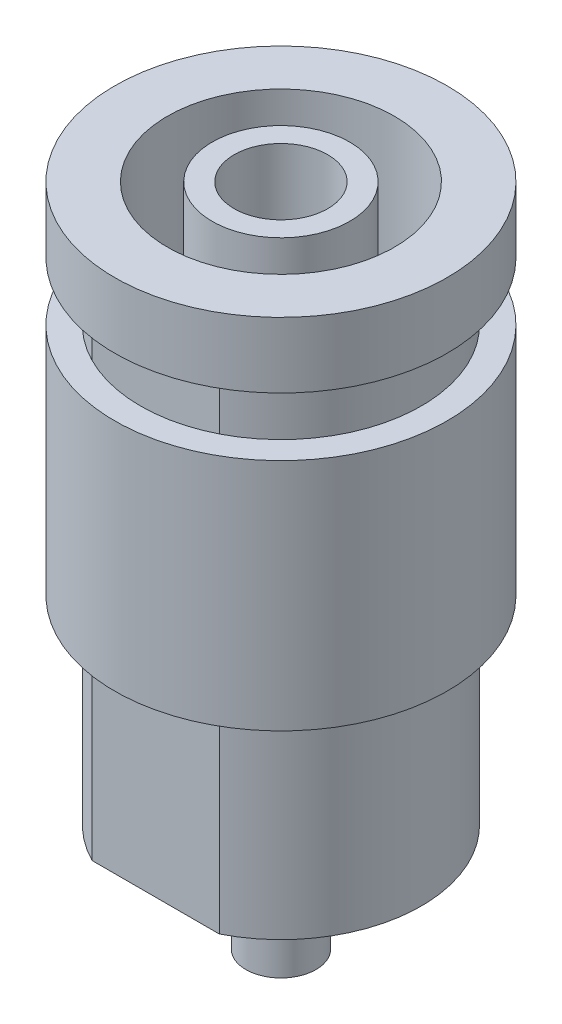
ISO-10303-21;
HEADER;
FILE_DESCRIPTION(('STEP AP214'),'2;1');
FILE_NAME('part.step','',(''),(''),'','','');
FILE_SCHEMA(('AUTOMOTIVE_DESIGN { 1 0 10303 214 1 1 1 1 }'));
ENDSEC;
DATA;
#1=APPLICATION_CONTEXT('core data for automotive mechanical design processes');
#2=APPLICATION_PROTOCOL_DEFINITION('international standard','automotive_design',2000,#1);
#3=PRODUCT_CONTEXT('',#1,'mechanical');
#4=PRODUCT('Part','Part','',(#3));
#5=PRODUCT_RELATED_PRODUCT_CATEGORY('part','',(#4));
#6=PRODUCT_DEFINITION_FORMATION('','',#4);
#7=PRODUCT_DEFINITION_CONTEXT('part definition',#1,'design');
#8=PRODUCT_DEFINITION('design','',#6,#7);
#9=PRODUCT_DEFINITION_SHAPE('','',#8);
#10=(LENGTH_UNIT() NAMED_UNIT(*) SI_UNIT(.MILLI.,.METRE.));
#11=(NAMED_UNIT(*) PLANE_ANGLE_UNIT() SI_UNIT($,.RADIAN.));
#12=(NAMED_UNIT(*) SI_UNIT($,.STERADIAN.) SOLID_ANGLE_UNIT());
#13=UNCERTAINTY_MEASURE_WITH_UNIT(LENGTH_MEASURE(1.E-05),#10,'distance_accuracy_value','');
#14=(GEOMETRIC_REPRESENTATION_CONTEXT(3) GLOBAL_UNCERTAINTY_ASSIGNED_CONTEXT((#13)) GLOBAL_UNIT_ASSIGNED_CONTEXT((#10,
#11,#12)) REPRESENTATION_CONTEXT('',''));
#15=CARTESIAN_POINT('',(0.,0.,0.));
#16=DIRECTION('',(0.,0.,1.));
#17=DIRECTION('',(1.,0.,0.));
#18=AXIS2_PLACEMENT_3D('',#15,#16,#17);
#19=CARTESIAN_POINT('',(0.,-21.7101449275362,0.));
#20=DIRECTION('',(0.,-1.,0.));
#21=DIRECTION('',(0.,0.,-1.));
#22=AXIS2_PLACEMENT_3D('',#19,#20,#21);
#23=CYLINDRICAL_SURFACE('',#22,6.);
#24=CARTESIAN_POINT('',(0.,-15.3,0.));
#25=DIRECTION('',(0.,-1.,0.));
#26=DIRECTION('',(0.,0.,-1.));
#27=AXIS2_PLACEMENT_3D('',#24,#25,#26);
#28=CIRCLE('',#27,6.);
#29=CARTESIAN_POINT('',(0.,-15.3,-6.));
#30=VERTEX_POINT('',#29);
#31=EDGE_CURVE('E57',#30,#30,#28,.T.);
#32=ORIENTED_EDGE('',*,*,#31,.T.);
#33=EDGE_LOOP('',(#32));
#34=FACE_BOUND('',#33,.T.);
#35=CARTESIAN_POINT('',(0.,-5.3,0.));
#36=DIRECTION('',(0.,-1.,0.));
#37=DIRECTION('',(0.,0.,-1.));
#38=AXIS2_PLACEMENT_3D('',#35,#36,#37);
#39=CIRCLE('',#38,6.);
#40=CARTESIAN_POINT('',(0.,-5.3,-6.));
#41=VERTEX_POINT('',#40);
#42=EDGE_CURVE('E12',#41,#41,#39,.T.);
#43=ORIENTED_EDGE('',*,*,#42,.F.);
#44=EDGE_LOOP('',(#43));
#45=FACE_BOUND('',#44,.T.);
#46=ADVANCED_FACE('F43',(#34,#45),#23,.F.);
#47=CARTESIAN_POINT('',(6.,-5.3,0.));
#48=DIRECTION('',(0.,1.,0.));
#49=DIRECTION('',(0.,0.,1.));
#50=AXIS2_PLACEMENT_3D('',#47,#48,#49);
#51=PLANE('',#50);
#52=ORIENTED_EDGE('',*,*,#42,.T.);
#53=EDGE_LOOP('',(#52));
#54=FACE_BOUND('',#53,.T.);
#55=CARTESIAN_POINT('',(0.,-5.3,0.));
#56=DIRECTION('',(0.,-1.,0.));
#57=DIRECTION('',(0.,0.,-1.));
#58=AXIS2_PLACEMENT_3D('',#55,#56,#57);
#59=CIRCLE('',#58,7.1);
#60=CARTESIAN_POINT('',(0.,-5.3,-7.1));
#61=VERTEX_POINT('',#60);
#62=EDGE_CURVE('E49',#61,#61,#59,.T.);
#63=ORIENTED_EDGE('',*,*,#62,.F.);
#64=EDGE_LOOP('',(#63));
#65=FACE_BOUND('',#64,.T.);
#66=ADVANCED_FACE('F73',(#54,#65),#51,.T.);
#67=CARTESIAN_POINT('',(0.,-21.7101449275362,0.));
#68=DIRECTION('',(0.,-1.,0.));
#69=DIRECTION('',(0.,0.,-1.));
#70=AXIS2_PLACEMENT_3D('',#67,#68,#69);
#71=CYLINDRICAL_SURFACE('',#70,7.1);
#72=ORIENTED_EDGE('',*,*,#62,.T.);
#73=EDGE_LOOP('',(#72));
#74=FACE_BOUND('',#73,.T.);
#75=CARTESIAN_POINT('',(0.,-15.3,0.));
#76=DIRECTION('',(0.,-1.,0.));
#77=DIRECTION('',(0.,0.,-1.));
#78=AXIS2_PLACEMENT_3D('',#75,#76,#77);
#79=CIRCLE('',#78,7.1);
#80=CARTESIAN_POINT('',(0.,-15.3,-7.1));
#81=VERTEX_POINT('',#80);
#82=EDGE_CURVE('E53',#81,#81,#79,.T.);
#83=ORIENTED_EDGE('',*,*,#82,.F.);
#84=EDGE_LOOP('',(#83));
#85=FACE_BOUND('',#84,.T.);
#86=ADVANCED_FACE('F67',(#74,#85),#71,.T.);
#87=CARTESIAN_POINT('',(6.,-15.3,0.));
#88=DIRECTION('',(0.,-1.,0.));
#89=DIRECTION('',(0.,0.,-1.));
#90=AXIS2_PLACEMENT_3D('',#87,#88,#89);
#91=PLANE('',#90);
#92=ORIENTED_EDGE('',*,*,#82,.T.);
#93=EDGE_LOOP('',(#92));
#94=FACE_BOUND('',#93,.T.);
#95=ORIENTED_EDGE('',*,*,#31,.F.);
#96=EDGE_LOOP('',(#95));
#97=FACE_BOUND('',#96,.T.);
#98=ADVANCED_FACE('F65',(#94,#97),#91,.T.);
#99=CLOSED_SHELL('',(#46,#66,#86,#98));
#100=MANIFOLD_SOLID_BREP('B2',#99);
#101=CARTESIAN_POINT('',(2.4478260869565,-23.8,0.));
#102=DIRECTION('',(0.,-1.,0.));
#103=DIRECTION('',(0.,0.,-1.));
#104=AXIS2_PLACEMENT_3D('',#101,#102,#103);
#105=PLANE('',#104);
#106=CARTESIAN_POINT('',(0.,-23.8,0.));
#107=DIRECTION('',(0.,-1.,0.));
#108=DIRECTION('',(0.,0.,-1.));
#109=AXIS2_PLACEMENT_3D('',#106,#107,#108);
#110=CIRCLE('',#109,2.4478260869565);
#111=CARTESIAN_POINT('',(0.,-23.8,-2.4478260869565));
#112=VERTEX_POINT('',#111);
#113=EDGE_CURVE('E173',#112,#112,#110,.T.);
#114=ORIENTED_EDGE('',*,*,#113,.F.);
#115=EDGE_LOOP('',(#114));
#116=FACE_BOUND('',#115,.T.);
#117=CARTESIAN_POINT('',(0.,-23.8,0.));
#118=DIRECTION('',(0.,-1.,0.));
#119=DIRECTION('',(0.,0.,-1.));
#120=AXIS2_PLACEMENT_3D('',#117,#118,#119);
#121=CIRCLE('',#120,6.);
#122=CARTESIAN_POINT('',(-2.71615537110822,-23.8,5.35));
#123=VERTEX_POINT('',#122);
#124=CARTESIAN_POINT('',(-2.71615537110821,-23.8,-5.35));
#125=VERTEX_POINT('',#124);
#126=EDGE_CURVE('E157',#123,#125,#121,.T.);
#127=ORIENTED_EDGE('',*,*,#126,.T.);
#128=DIRECTION('',(1.,0.,0.));
#129=VECTOR('',#128,1.);
#130=CARTESIAN_POINT('',(15.6689617347752,-23.8,-5.35));
#131=LINE('',#130,#129);
#132=CARTESIAN_POINT('',(2.71615537110821,-23.8,-5.35));
#133=VERTEX_POINT('',#132);
#134=EDGE_CURVE('E409',#125,#133,#131,.T.);
#135=ORIENTED_EDGE('',*,*,#134,.T.);
#136=CARTESIAN_POINT('',(2.71615537110821,-23.8,5.35));
#137=VERTEX_POINT('',#136);
#138=EDGE_CURVE('E170',#133,#137,#121,.T.);
#139=ORIENTED_EDGE('',*,*,#138,.T.);
#140=DIRECTION('',(-1.,0.,0.));
#141=VECTOR('',#140,1.);
#142=CARTESIAN_POINT('',(15.6689617347752,-23.8,5.35));
#143=LINE('',#142,#141);
#144=EDGE_CURVE('E412',#137,#123,#143,.T.);
#145=ORIENTED_EDGE('',*,*,#144,.T.);
#146=EDGE_LOOP('',(#127,#135,#139,#145));
#147=FACE_BOUND('',#146,.T.);
#148=ADVANCED_FACE('F104',(#116,#147),#105,.T.);
#149=CARTESIAN_POINT('',(0.,-21.7101449275362,0.));
#150=DIRECTION('',(0.,-1.,0.));
#151=DIRECTION('',(0.,0.,-1.));
#152=AXIS2_PLACEMENT_3D('',#149,#150,#151);
#153=CYLINDRICAL_SURFACE('',#152,6.);
#154=ORIENTED_EDGE('',*,*,#138,.F.);
#155=DIRECTION('',(0.,-1.,0.));
#156=VECTOR('',#155,1.);
#157=CARTESIAN_POINT('',(2.71615537110821,-21.7101449275362,-5.35));
#158=LINE('',#157,#156);
#159=CARTESIAN_POINT('',(2.71615537110821,-2.8,-5.35));
#160=VERTEX_POINT('',#159);
#161=EDGE_CURVE('E166',#133,#160,#158,.F.);
#162=ORIENTED_EDGE('',*,*,#161,.T.);
#163=CARTESIAN_POINT('',(0.,-2.8,0.));
#164=DIRECTION('',(0.,-1.,0.));
#165=DIRECTION('',(0.,0.,-1.));
#166=AXIS2_PLACEMENT_3D('',#163,#164,#165);
#167=CIRCLE('',#166,6.);
#168=CARTESIAN_POINT('',(2.71615537110821,-2.8,5.35));
#169=VERTEX_POINT('',#168);
#170=EDGE_CURVE('E162',#160,#169,#167,.T.);
#171=ORIENTED_EDGE('',*,*,#170,.T.);
#172=DIRECTION('',(0.,-1.,0.));
#173=VECTOR('',#172,1.);
#174=CARTESIAN_POINT('',(2.71615537110822,-21.7101449275362,5.35));
#175=LINE('',#174,#173);
#176=EDGE_CURVE('E147',#169,#137,#175,.T.);
#177=ORIENTED_EDGE('',*,*,#176,.T.);
#178=EDGE_LOOP('',(#154,#162,#171,#177));
#179=FACE_BOUND('',#178,.T.);
#180=ADVANCED_FACE('F221',(#179),#153,.T.);
#181=CARTESIAN_POINT('',(-2.71615537110821,-2.8,5.35));
#182=VERTEX_POINT('',#181);
#183=CARTESIAN_POINT('',(-2.71615537110821,-2.8,-5.35));
#184=VERTEX_POINT('',#183);
#185=EDGE_CURVE('E155',#182,#184,#167,.T.);
#186=ORIENTED_EDGE('',*,*,#185,.T.);
#187=DIRECTION('',(0.,-1.,0.));
#188=VECTOR('',#187,1.);
#189=CARTESIAN_POINT('',(-2.71615537110821,-21.7101449275362,-5.35));
#190=LINE('',#189,#188);
#191=EDGE_CURVE('E158',#184,#125,#190,.T.);
#192=ORIENTED_EDGE('',*,*,#191,.T.);
#193=ORIENTED_EDGE('',*,*,#126,.F.);
#194=DIRECTION('',(0.,-1.,0.));
#195=VECTOR('',#194,1.);
#196=CARTESIAN_POINT('',(-2.71615537110822,-21.7101449275362,5.35));
#197=LINE('',#196,#195);
#198=EDGE_CURVE('E144',#123,#182,#197,.F.);
#199=ORIENTED_EDGE('',*,*,#198,.T.);
#200=EDGE_LOOP('',(#186,#192,#193,#199));
#201=FACE_BOUND('',#200,.T.);
#202=ADVANCED_FACE('F153',(#201),#153,.T.);
#203=CARTESIAN_POINT('',(0.,-21.7101449275362,0.));
#204=DIRECTION('',(0.,-1.,0.));
#205=DIRECTION('',(0.,0.,-1.));
#206=AXIS2_PLACEMENT_3D('',#203,#204,#205);
#207=CYLINDRICAL_SURFACE('',#206,7.1);
#208=CARTESIAN_POINT('',(0.,0.,0.));
#209=DIRECTION('',(0.,-1.,0.));
#210=DIRECTION('',(0.,0.,-1.));
#211=AXIS2_PLACEMENT_3D('',#208,#209,#210);
#212=CIRCLE('',#211,7.1);
#213=CARTESIAN_POINT('',(0.,0.,-7.1));
#214=VERTEX_POINT('',#213);
#215=EDGE_CURVE('E41',#214,#214,#212,.T.);
#216=ORIENTED_EDGE('',*,*,#215,.T.);
#217=EDGE_LOOP('',(#216));
#218=FACE_BOUND('',#217,.T.);
#219=CARTESIAN_POINT('',(0.,-2.8,0.));
#220=DIRECTION('',(0.,-1.,0.));
#221=DIRECTION('',(0.,0.,-1.));
#222=AXIS2_PLACEMENT_3D('',#219,#220,#221);
#223=CIRCLE('',#222,7.1);
#224=CARTESIAN_POINT('',(0.,-2.8,-7.1));
#225=VERTEX_POINT('',#224);
#226=EDGE_CURVE('E163',#225,#225,#223,.T.);
#227=ORIENTED_EDGE('',*,*,#226,.F.);
#228=EDGE_LOOP('',(#227));
#229=FACE_BOUND('',#228,.T.);
#230=ADVANCED_FACE('F106',(#218,#229),#207,.T.);
#231=CARTESIAN_POINT('',(7.1,0.,0.));
#232=DIRECTION('',(0.,1.,0.));
#233=DIRECTION('',(0.,0.,1.));
#234=AXIS2_PLACEMENT_3D('',#231,#232,#233);
#235=PLANE('',#234);
#236=CARTESIAN_POINT('',(0.,0.,0.));
#237=DIRECTION('',(0.,-1.,0.));
#238=DIRECTION('',(0.,0.,-1.));
#239=AXIS2_PLACEMENT_3D('',#236,#237,#238);
#240=CIRCLE('',#239,4.85);
#241=CARTESIAN_POINT('',(0.,0.,-4.85));
#242=VERTEX_POINT('',#241);
#243=EDGE_CURVE('E112',#242,#242,#240,.T.);
#244=ORIENTED_EDGE('',*,*,#243,.T.);
#245=EDGE_LOOP('',(#244));
#246=FACE_BOUND('',#245,.T.);
#247=ORIENTED_EDGE('',*,*,#215,.F.);
#248=EDGE_LOOP('',(#247));
#249=FACE_BOUND('',#248,.T.);
#250=ADVANCED_FACE('F205',(#246,#249),#235,.T.);
#251=CARTESIAN_POINT('',(0.,-21.7101449275362,0.));
#252=DIRECTION('',(0.,-1.,0.));
#253=DIRECTION('',(0.,0.,-1.));
#254=AXIS2_PLACEMENT_3D('',#251,#252,#253);
#255=CYLINDRICAL_SURFACE('',#254,4.85);
#256=CARTESIAN_POINT('',(0.,-21.7101449275362,0.));
#257=DIRECTION('',(0.,-1.,0.));
#258=DIRECTION('',(0.,0.,-1.));
#259=AXIS2_PLACEMENT_3D('',#256,#257,#258);
#260=CIRCLE('',#259,4.85);
#261=CARTESIAN_POINT('',(0.,-21.7101449275362,-4.85));
#262=VERTEX_POINT('',#261);
#263=EDGE_CURVE('E200',#262,#262,#260,.T.);
#264=ORIENTED_EDGE('',*,*,#263,.T.);
#265=EDGE_LOOP('',(#264));
#266=FACE_BOUND('',#265,.T.);
#267=ORIENTED_EDGE('',*,*,#243,.F.);
#268=EDGE_LOOP('',(#267));
#269=FACE_BOUND('',#268,.T.);
#270=ADVANCED_FACE('F208',(#266,#269),#255,.F.);
#271=CARTESIAN_POINT('',(4.85,-21.7101449275362,0.));
#272=DIRECTION('',(0.,1.,0.));
#273=DIRECTION('',(0.,0.,1.));
#274=AXIS2_PLACEMENT_3D('',#271,#272,#273);
#275=PLANE('',#274);
#276=CARTESIAN_POINT('',(0.,-21.7101449275362,0.));
#277=DIRECTION('',(0.,-1.,0.));
#278=DIRECTION('',(0.,0.,-1.));
#279=AXIS2_PLACEMENT_3D('',#276,#277,#278);
#280=CIRCLE('',#279,2.93672740552942);
#281=CARTESIAN_POINT('',(0.,-21.7101449275362,-2.93672740552942));
#282=VERTEX_POINT('',#281);
#283=EDGE_CURVE('E197',#282,#282,#280,.T.);
#284=ORIENTED_EDGE('',*,*,#283,.T.);
#285=EDGE_LOOP('',(#284));
#286=FACE_BOUND('',#285,.T.);
#287=ORIENTED_EDGE('',*,*,#263,.F.);
#288=EDGE_LOOP('',(#287));
#289=FACE_BOUND('',#288,.T.);
#290=ADVANCED_FACE('F210',(#286,#289),#275,.T.);
#291=CARTESIAN_POINT('',(0.,-21.7101449275362,0.));
#292=DIRECTION('',(0.,-1.,0.));
#293=DIRECTION('',(0.,0.,-1.));
#294=AXIS2_PLACEMENT_3D('',#291,#292,#293);
#295=CYLINDRICAL_SURFACE('',#294,2.93672740552942);
#296=CARTESIAN_POINT('',(0.,0.,0.));
#297=DIRECTION('',(0.,-1.,0.));
#298=DIRECTION('',(0.,0.,-1.));
#299=AXIS2_PLACEMENT_3D('',#296,#297,#298);
#300=CIRCLE('',#299,2.93672740552942);
#301=CARTESIAN_POINT('',(0.,0.,-2.93672740552942));
#302=VERTEX_POINT('',#301);
#303=EDGE_CURVE('E194',#302,#302,#300,.T.);
#304=ORIENTED_EDGE('',*,*,#303,.T.);
#305=EDGE_LOOP('',(#304));
#306=FACE_BOUND('',#305,.T.);
#307=ORIENTED_EDGE('',*,*,#283,.F.);
#308=EDGE_LOOP('',(#307));
#309=FACE_BOUND('',#308,.T.);
#310=ADVANCED_FACE('F217',(#306,#309),#295,.T.);
#311=CARTESIAN_POINT('',(2.93672740552942,0.,0.));
#312=DIRECTION('',(0.,1.,0.));
#313=DIRECTION('',(0.,0.,1.));
#314=AXIS2_PLACEMENT_3D('',#311,#312,#313);
#315=PLANE('',#314);
#316=CARTESIAN_POINT('',(0.,0.,0.));
#317=DIRECTION('',(0.,-1.,0.));
#318=DIRECTION('',(0.,0.,-1.));
#319=AXIS2_PLACEMENT_3D('',#316,#317,#318);
#320=CIRCLE('',#319,2.);
#321=CARTESIAN_POINT('',(0.,0.,-2.));
#322=VERTEX_POINT('',#321);
#323=EDGE_CURVE('E191',#322,#322,#320,.T.);
#324=ORIENTED_EDGE('',*,*,#323,.T.);
#325=EDGE_LOOP('',(#324));
#326=FACE_BOUND('',#325,.T.);
#327=ORIENTED_EDGE('',*,*,#303,.F.);
#328=EDGE_LOOP('',(#327));
#329=FACE_BOUND('',#328,.T.);
#330=ADVANCED_FACE('F260',(#326,#329),#315,.T.);
#331=CARTESIAN_POINT('',(0.,-21.7101449275362,0.));
#332=DIRECTION('',(0.,-1.,0.));
#333=DIRECTION('',(0.,0.,-1.));
#334=AXIS2_PLACEMENT_3D('',#331,#332,#333);
#335=CYLINDRICAL_SURFACE('',#334,2.);
#336=CARTESIAN_POINT('',(0.,-21.7101449275362,0.));
#337=DIRECTION('',(0.,-1.,0.));
#338=DIRECTION('',(0.,0.,-1.));
#339=AXIS2_PLACEMENT_3D('',#336,#337,#338);
#340=CIRCLE('',#339,2.);
#341=CARTESIAN_POINT('',(0.,-21.7101449275362,-2.));
#342=VERTEX_POINT('',#341);
#343=EDGE_CURVE('E188',#342,#342,#340,.T.);
#344=ORIENTED_EDGE('',*,*,#343,.T.);
#345=EDGE_LOOP('',(#344));
#346=FACE_BOUND('',#345,.T.);
#347=ORIENTED_EDGE('',*,*,#323,.F.);
#348=EDGE_LOOP('',(#347));
#349=FACE_BOUND('',#348,.T.);
#350=ADVANCED_FACE('F256',(#346,#349),#335,.F.);
#351=CARTESIAN_POINT('',(2.,-21.7101449275362,0.));
#352=DIRECTION('',(0.,1.,0.));
#353=DIRECTION('',(0.,0.,1.));
#354=AXIS2_PLACEMENT_3D('',#351,#352,#353);
#355=PLANE('',#354);
#356=ORIENTED_EDGE('',*,*,#343,.F.);
#357=EDGE_LOOP('',(#356));
#358=FACE_BOUND('',#357,.T.);
#359=ADVANCED_FACE('F252',(#358),#355,.T.);
#360=CARTESIAN_POINT('',(0.,-24.7478260869565,0.));
#361=DIRECTION('',(0.,-1.,0.));
#362=DIRECTION('',(0.,0.,-1.));
#363=AXIS2_PLACEMENT_3D('',#360,#361,#362);
#364=PLANE('',#363);
#365=CARTESIAN_POINT('',(0.,-24.7478260869565,0.));
#366=DIRECTION('',(0.,-1.,0.));
#367=DIRECTION('',(0.,0.,-1.));
#368=AXIS2_PLACEMENT_3D('',#365,#366,#367);
#369=CIRCLE('',#368,1.);
#370=CARTESIAN_POINT('',(0.,-24.7478260869565,-1.));
#371=VERTEX_POINT('',#370);
#372=EDGE_CURVE('E185',#371,#371,#369,.T.);
#373=ORIENTED_EDGE('',*,*,#372,.T.);
#374=EDGE_LOOP('',(#373));
#375=FACE_BOUND('',#374,.T.);
#376=ADVANCED_FACE('F248',(#375),#364,.T.);
#377=CARTESIAN_POINT('',(0.,-21.7101449275362,0.));
#378=DIRECTION('',(0.,-1.,0.));
#379=DIRECTION('',(0.,0.,-1.));
#380=AXIS2_PLACEMENT_3D('',#377,#378,#379);
#381=CYLINDRICAL_SURFACE('',#380,1.);
#382=CARTESIAN_POINT('',(0.,-28.4,0.));
#383=DIRECTION('',(0.,-1.,0.));
#384=DIRECTION('',(0.,0.,-1.));
#385=AXIS2_PLACEMENT_3D('',#382,#383,#384);
#386=CIRCLE('',#385,1.);
#387=CARTESIAN_POINT('',(0.,-28.4,-1.));
#388=VERTEX_POINT('',#387);
#389=EDGE_CURVE('E182',#388,#388,#386,.T.);
#390=ORIENTED_EDGE('',*,*,#389,.T.);
#391=EDGE_LOOP('',(#390));
#392=FACE_BOUND('',#391,.T.);
#393=ORIENTED_EDGE('',*,*,#372,.F.);
#394=EDGE_LOOP('',(#393));
#395=FACE_BOUND('',#394,.T.);
#396=ADVANCED_FACE('F244',(#392,#395),#381,.F.);
#397=CARTESIAN_POINT('',(1.,-28.4,0.));
#398=DIRECTION('',(0.,-1.,0.));
#399=DIRECTION('',(0.,0.,-1.));
#400=AXIS2_PLACEMENT_3D('',#397,#398,#399);
#401=PLANE('',#400);
#402=CARTESIAN_POINT('',(0.,-28.4,0.));
#403=DIRECTION('',(0.,-1.,0.));
#404=DIRECTION('',(0.,0.,-1.));
#405=AXIS2_PLACEMENT_3D('',#402,#403,#404);
#406=CIRCLE('',#405,1.5);
#407=CARTESIAN_POINT('',(0.,-28.4,-1.5));
#408=VERTEX_POINT('',#407);
#409=EDGE_CURVE('E179',#408,#408,#406,.T.);
#410=ORIENTED_EDGE('',*,*,#409,.T.);
#411=EDGE_LOOP('',(#410));
#412=FACE_BOUND('',#411,.T.);
#413=ORIENTED_EDGE('',*,*,#389,.F.);
#414=EDGE_LOOP('',(#413));
#415=FACE_BOUND('',#414,.T.);
#416=ADVANCED_FACE('F240',(#412,#415),#401,.T.);
#417=CARTESIAN_POINT('',(0.,-21.7101449275362,0.));
#418=DIRECTION('',(0.,-1.,0.));
#419=DIRECTION('',(0.,0.,-1.));
#420=AXIS2_PLACEMENT_3D('',#417,#418,#419);
#421=CYLINDRICAL_SURFACE('',#420,1.5);
#422=CARTESIAN_POINT('',(0.,-24.7478260869565,0.));
#423=DIRECTION('',(0.,-1.,0.));
#424=DIRECTION('',(0.,0.,-1.));
#425=AXIS2_PLACEMENT_3D('',#422,#423,#424);
#426=CIRCLE('',#425,1.5);
#427=CARTESIAN_POINT('',(0.,-24.7478260869565,-1.5));
#428=VERTEX_POINT('',#427);
#429=EDGE_CURVE('E176',#428,#428,#426,.T.);
#430=ORIENTED_EDGE('',*,*,#429,.T.);
#431=EDGE_LOOP('',(#430));
#432=FACE_BOUND('',#431,.T.);
#433=ORIENTED_EDGE('',*,*,#409,.F.);
#434=EDGE_LOOP('',(#433));
#435=FACE_BOUND('',#434,.T.);
#436=ADVANCED_FACE('F236',(#432,#435),#421,.T.);
#437=CARTESIAN_POINT('',(0.,-24.7478260869565,0.));
#438=DIRECTION('',(0.,1.,0.));
#439=DIRECTION('',(0.,0.,1.));
#440=AXIS2_PLACEMENT_3D('',#437,#438,#439);
#441=CONICAL_SURFACE('',#440,1.5,0.785398163397448);
#442=ORIENTED_EDGE('',*,*,#113,.T.);
#443=EDGE_LOOP('',(#442));
#444=FACE_BOUND('',#443,.T.);
#445=ORIENTED_EDGE('',*,*,#429,.F.);
#446=EDGE_LOOP('',(#445));
#447=FACE_BOUND('',#446,.T.);
#448=ADVANCED_FACE('F233',(#444,#447),#441,.T.);
#449=CARTESIAN_POINT('',(6.,-2.8,0.));
#450=DIRECTION('',(0.,-1.,0.));
#451=DIRECTION('',(0.,0.,-1.));
#452=AXIS2_PLACEMENT_3D('',#449,#450,#451);
#453=PLANE('',#452);
#454=ORIENTED_EDGE('',*,*,#170,.F.);
#455=DIRECTION('',(-1.,0.,0.));
#456=VECTOR('',#455,1.);
#457=CARTESIAN_POINT('',(15.6689617347752,-2.8,-5.35));
#458=LINE('',#457,#456);
#459=EDGE_CURVE('E119',#160,#184,#458,.T.);
#460=ORIENTED_EDGE('',*,*,#459,.T.);
#461=ORIENTED_EDGE('',*,*,#185,.F.);
#462=DIRECTION('',(1.,0.,0.));
#463=VECTOR('',#462,1.);
#464=CARTESIAN_POINT('',(15.6689617347752,-2.8,5.35));
#465=LINE('',#464,#463);
#466=EDGE_CURVE('E124',#182,#169,#465,.T.);
#467=ORIENTED_EDGE('',*,*,#466,.T.);
#468=EDGE_LOOP('',(#454,#460,#461,#467));
#469=FACE_BOUND('',#468,.T.);
#470=ORIENTED_EDGE('',*,*,#226,.T.);
#471=EDGE_LOOP('',(#470));
#472=FACE_BOUND('',#471,.T.);
#473=ADVANCED_FACE('F160',(#469,#472),#453,.T.);
#474=CARTESIAN_POINT('',(15.6689617347752,33.0622184290546,-5.35));
#475=DIRECTION('',(0.,0.,-1.));
#476=DIRECTION('',(-1.,0.,0.));
#477=AXIS2_PLACEMENT_3D('',#474,#475,#476);
#478=PLANE('',#477);
#479=ORIENTED_EDGE('',*,*,#134,.F.);
#480=ORIENTED_EDGE('',*,*,#191,.F.);
#481=ORIENTED_EDGE('',*,*,#459,.F.);
#482=ORIENTED_EDGE('',*,*,#161,.F.);
#483=EDGE_LOOP('',(#479,#480,#481,#482));
#484=FACE_BOUND('',#483,.T.);
#485=ADVANCED_FACE('F316',(#484),#478,.T.);
#486=CARTESIAN_POINT('',(15.6689617347752,33.0622184290546,5.35));
#487=DIRECTION('',(0.,0.,1.));
#488=DIRECTION('',(1.,0.,0.));
#489=AXIS2_PLACEMENT_3D('',#486,#487,#488);
#490=PLANE('',#489);
#491=ORIENTED_EDGE('',*,*,#144,.F.);
#492=ORIENTED_EDGE('',*,*,#176,.F.);
#493=ORIENTED_EDGE('',*,*,#466,.F.);
#494=ORIENTED_EDGE('',*,*,#198,.F.);
#495=EDGE_LOOP('',(#491,#492,#493,#494));
#496=FACE_BOUND('',#495,.T.);
#497=ADVANCED_FACE('F143',(#496),#490,.T.);
#498=CLOSED_SHELL('',(#148,#180,#202,#230,#250,#270,#290,#310,#330,#350,#359,#376,#396,#416,
#436,#448,#473,#485,#497));
#499=MANIFOLD_SOLID_BREP('B7',#498);
#500=ADVANCED_BREP_SHAPE_REPRESENTATION('',(#18,#100,#499),#14);
#501=SHAPE_DEFINITION_REPRESENTATION(#9,#500);
ENDSEC;
END-ISO-10303-21;
